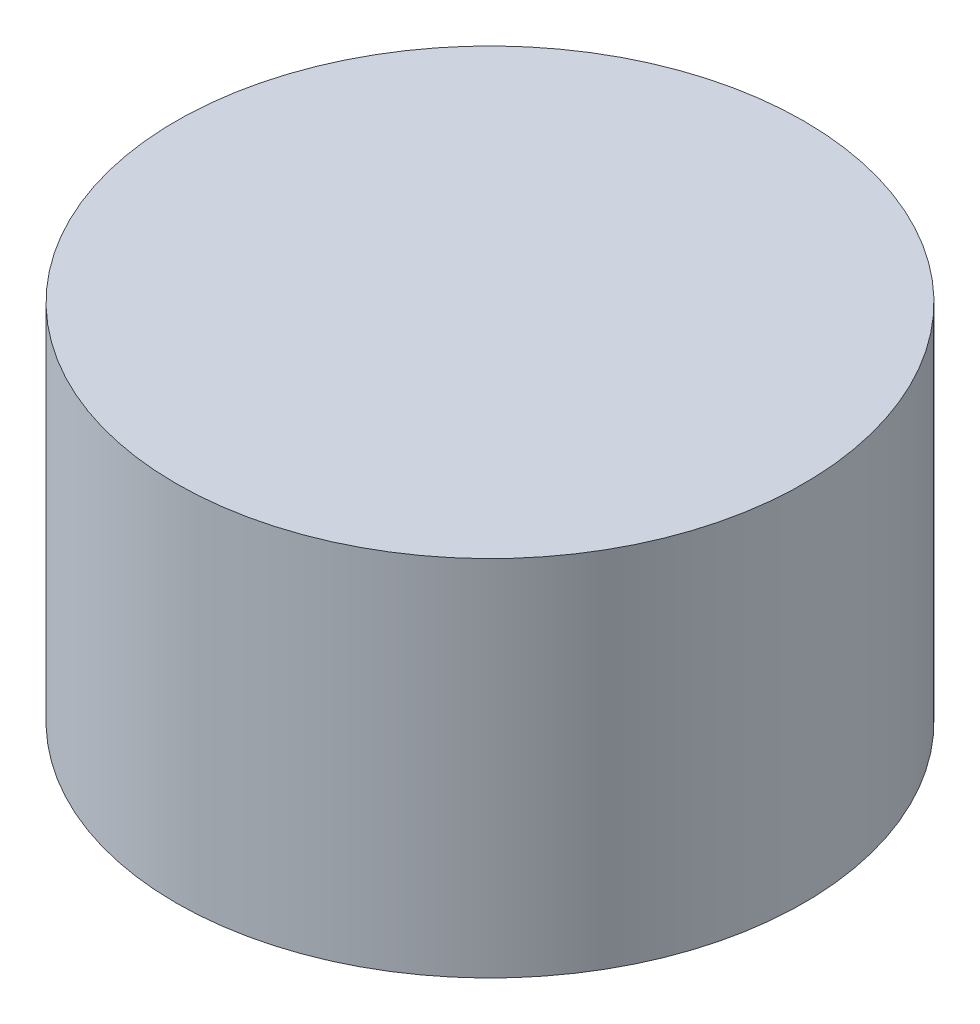
ISO-10303-21;
HEADER;
FILE_DESCRIPTION(('STEP AP214'),'2;1');
FILE_NAME('part.step','',(''),(''),'','','');
FILE_SCHEMA(('AUTOMOTIVE_DESIGN { 1 0 10303 214 1 1 1 1 }'));
ENDSEC;
DATA;
#1=APPLICATION_CONTEXT('core data for automotive mechanical design processes');
#2=APPLICATION_PROTOCOL_DEFINITION('international standard','automotive_design',2000,#1);
#3=PRODUCT_CONTEXT('',#1,'mechanical');
#4=PRODUCT('Part','Part','',(#3));
#5=PRODUCT_RELATED_PRODUCT_CATEGORY('part','',(#4));
#6=PRODUCT_DEFINITION_FORMATION('','',#4);
#7=PRODUCT_DEFINITION_CONTEXT('part definition',#1,'design');
#8=PRODUCT_DEFINITION('design','',#6,#7);
#9=PRODUCT_DEFINITION_SHAPE('','',#8);
#10=(LENGTH_UNIT() NAMED_UNIT(*) SI_UNIT(.MILLI.,.METRE.));
#11=(NAMED_UNIT(*) PLANE_ANGLE_UNIT() SI_UNIT($,.RADIAN.));
#12=(NAMED_UNIT(*) SI_UNIT($,.STERADIAN.) SOLID_ANGLE_UNIT());
#13=UNCERTAINTY_MEASURE_WITH_UNIT(LENGTH_MEASURE(1.E-05),#10,'distance_accuracy_value','');
#14=(GEOMETRIC_REPRESENTATION_CONTEXT(3) GLOBAL_UNCERTAINTY_ASSIGNED_CONTEXT((#13)) GLOBAL_UNIT_ASSIGNED_CONTEXT((#10,
#11,#12)) REPRESENTATION_CONTEXT('',''));
#15=CARTESIAN_POINT('',(0.,0.,0.));
#16=DIRECTION('',(0.,0.,1.));
#17=DIRECTION('',(1.,0.,0.));
#18=AXIS2_PLACEMENT_3D('',#15,#16,#17);
#19=CARTESIAN_POINT('',(0.,70.,0.));
#20=DIRECTION('',(0.,-1.,0.));
#21=DIRECTION('',(0.,0.,-1.));
#22=AXIS2_PLACEMENT_3D('',#19,#20,#21);
#23=CYLINDRICAL_SURFACE('',#22,60.5);
#24=CARTESIAN_POINT('',(0.,70.,0.));
#25=DIRECTION('',(0.,1.,0.));
#26=DIRECTION('',(0.,0.,1.));
#27=AXIS2_PLACEMENT_3D('',#24,#25,#26);
#28=CIRCLE('',#27,60.5);
#29=CARTESIAN_POINT('',(0.,70.,60.5));
#30=VERTEX_POINT('',#29);
#31=EDGE_CURVE('E10',#30,#30,#28,.T.);
#32=ORIENTED_EDGE('',*,*,#31,.F.);
#33=EDGE_LOOP('',(#32));
#34=FACE_BOUND('',#33,.T.);
#35=CARTESIAN_POINT('',(0.,0.,0.));
#36=DIRECTION('',(0.,1.,0.));
#37=DIRECTION('',(0.,0.,1.));
#38=AXIS2_PLACEMENT_3D('',#35,#36,#37);
#39=CIRCLE('',#38,60.5);
#40=CARTESIAN_POINT('',(0.,0.,60.5));
#41=VERTEX_POINT('',#40);
#42=EDGE_CURVE('E31',#41,#41,#39,.T.);
#43=ORIENTED_EDGE('',*,*,#42,.T.);
#44=EDGE_LOOP('',(#43));
#45=FACE_BOUND('',#44,.T.);
#46=ADVANCED_FACE('F28',(#34,#45),#23,.T.);
#47=CARTESIAN_POINT('',(0.,70.,0.));
#48=DIRECTION('',(0.,1.,0.));
#49=DIRECTION('',(0.,0.,1.));
#50=AXIS2_PLACEMENT_3D('',#47,#48,#49);
#51=PLANE('',#50);
#52=ORIENTED_EDGE('',*,*,#31,.T.);
#53=EDGE_LOOP('',(#52));
#54=FACE_BOUND('',#53,.T.);
#55=ADVANCED_FACE('F43',(#54),#51,.T.);
#56=CARTESIAN_POINT('',(0.,0.,0.));
#57=DIRECTION('',(0.,1.,0.));
#58=DIRECTION('',(0.,0.,1.));
#59=AXIS2_PLACEMENT_3D('',#56,#57,#58);
#60=PLANE('',#59);
#61=ORIENTED_EDGE('',*,*,#42,.F.);
#62=EDGE_LOOP('',(#61));
#63=FACE_BOUND('',#62,.T.);
#64=ADVANCED_FACE('F41',(#63),#60,.F.);
#65=CLOSED_SHELL('',(#46,#55,#64));
#66=MANIFOLD_SOLID_BREP('B2',#65);
#67=ADVANCED_BREP_SHAPE_REPRESENTATION('',(#18,#66),#14);
#68=SHAPE_DEFINITION_REPRESENTATION(#9,#67);
ENDSEC;
END-ISO-10303-21;
